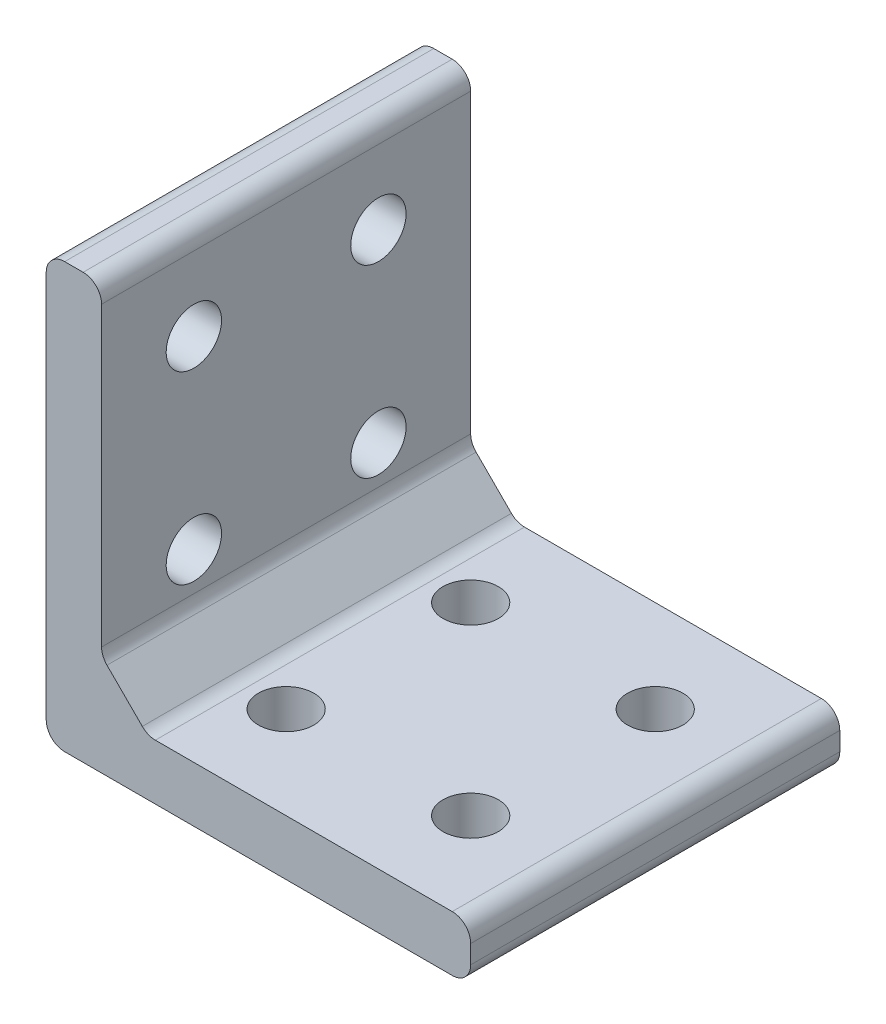
ISO-10303-21;
HEADER;
FILE_DESCRIPTION(('STEP AP214'),'2;1');
FILE_NAME('part.step','',(''),(''),'','','');
FILE_SCHEMA(('AUTOMOTIVE_DESIGN { 1 0 10303 214 1 1 1 1 }'));
ENDSEC;
DATA;
#1=APPLICATION_CONTEXT('core data for automotive mechanical design processes');
#2=APPLICATION_PROTOCOL_DEFINITION('international standard','automotive_design',2000,#1);
#3=PRODUCT_CONTEXT('',#1,'mechanical');
#4=PRODUCT('Part','Part','',(#3));
#5=PRODUCT_RELATED_PRODUCT_CATEGORY('part','',(#4));
#6=PRODUCT_DEFINITION_FORMATION('','',#4);
#7=PRODUCT_DEFINITION_CONTEXT('part definition',#1,'design');
#8=PRODUCT_DEFINITION('design','',#6,#7);
#9=PRODUCT_DEFINITION_SHAPE('','',#8);
#10=(LENGTH_UNIT() NAMED_UNIT(*) SI_UNIT(.MILLI.,.METRE.));
#11=(NAMED_UNIT(*) PLANE_ANGLE_UNIT() SI_UNIT($,.RADIAN.));
#12=(NAMED_UNIT(*) SI_UNIT($,.STERADIAN.) SOLID_ANGLE_UNIT());
#13=UNCERTAINTY_MEASURE_WITH_UNIT(LENGTH_MEASURE(1.E-05),#10,'distance_accuracy_value','');
#14=(GEOMETRIC_REPRESENTATION_CONTEXT(3) GLOBAL_UNCERTAINTY_ASSIGNED_CONTEXT((#13)) GLOBAL_UNIT_ASSIGNED_CONTEXT((#10,
#11,#12)) REPRESENTATION_CONTEXT('',''));
#15=CARTESIAN_POINT('',(0.,0.,0.));
#16=DIRECTION('',(0.,0.,1.));
#17=DIRECTION('',(1.,0.,0.));
#18=AXIS2_PLACEMENT_3D('',#15,#16,#17);
#19=CARTESIAN_POINT('',(23.,3.,20.));
#20=DIRECTION('',(-1.,0.,0.));
#21=DIRECTION('',(0.,-1.,0.));
#22=AXIS2_PLACEMENT_3D('',#19,#20,#21);
#23=PLANE('',#22);
#24=DIRECTION('',(0.,1.,0.));
#25=VECTOR('',#24,1.);
#26=CARTESIAN_POINT('',(23.,3.,0.));
#27=LINE('',#26,#25);
#28=CARTESIAN_POINT('',(23.,0.999999999999997,0.));
#29=VERTEX_POINT('',#28);
#30=CARTESIAN_POINT('',(23.,2.,0.));
#31=VERTEX_POINT('',#30);
#32=EDGE_CURVE('E174',#29,#31,#27,.T.);
#33=ORIENTED_EDGE('',*,*,#32,.T.);
#34=DIRECTION('',(0.,0.,-1.));
#35=VECTOR('',#34,1.);
#36=CARTESIAN_POINT('',(23.,2.,20.));
#37=LINE('',#36,#35);
#38=CARTESIAN_POINT('',(23.,2.,20.));
#39=VERTEX_POINT('',#38);
#40=EDGE_CURVE('E147',#31,#39,#37,.F.);
#41=ORIENTED_EDGE('',*,*,#40,.T.);
#42=DIRECTION('',(0.,1.,0.));
#43=VECTOR('',#42,1.);
#44=CARTESIAN_POINT('',(23.,3.,20.));
#45=LINE('',#44,#43);
#46=CARTESIAN_POINT('',(23.,0.999999999999997,20.));
#47=VERTEX_POINT('',#46);
#48=EDGE_CURVE('E195',#47,#39,#45,.T.);
#49=ORIENTED_EDGE('',*,*,#48,.F.);
#50=DIRECTION('',(0.,0.,-1.));
#51=VECTOR('',#50,1.);
#52=CARTESIAN_POINT('',(23.,0.999999999999997,20.));
#53=LINE('',#52,#51);
#54=EDGE_CURVE('E153',#47,#29,#53,.T.);
#55=ORIENTED_EDGE('',*,*,#54,.T.);
#56=EDGE_LOOP('',(#33,#41,#49,#55));
#57=FACE_BOUND('',#56,.T.);
#58=ADVANCED_FACE('F39',(#57),#23,.F.);
#59=CARTESIAN_POINT('',(3.,3.,20.));
#60=DIRECTION('',(0.,-1.,0.));
#61=DIRECTION('',(1.,0.,0.));
#62=AXIS2_PLACEMENT_3D('',#59,#60,#61);
#63=PLANE('',#62);
#64=CARTESIAN_POINT('',(7.99999999999997,3.,5.));
#65=DIRECTION('',(0.,1.,0.));
#66=DIRECTION('',(-1.,0.,0.));
#67=AXIS2_PLACEMENT_3D('',#64,#65,#66);
#68=CIRCLE('',#67,1.5);
#69=CARTESIAN_POINT('',(6.49999999999997,3.,5.));
#70=VERTEX_POINT('',#69);
#71=EDGE_CURVE('E229',#70,#70,#68,.T.);
#72=ORIENTED_EDGE('',*,*,#71,.F.);
#73=EDGE_LOOP('',(#72));
#74=FACE_BOUND('',#73,.T.);
#75=CARTESIAN_POINT('',(18.,3.,5.));
#76=DIRECTION('',(0.,1.,0.));
#77=DIRECTION('',(-1.,0.,0.));
#78=AXIS2_PLACEMENT_3D('',#75,#76,#77);
#79=CIRCLE('',#78,1.5);
#80=CARTESIAN_POINT('',(16.5,3.,5.));
#81=VERTEX_POINT('',#80);
#82=EDGE_CURVE('E479',#81,#81,#79,.T.);
#83=ORIENTED_EDGE('',*,*,#82,.F.);
#84=EDGE_LOOP('',(#83));
#85=FACE_BOUND('',#84,.T.);
#86=CARTESIAN_POINT('',(18.,3.,15.));
#87=DIRECTION('',(0.,1.,0.));
#88=DIRECTION('',(-1.,0.,0.));
#89=AXIS2_PLACEMENT_3D('',#86,#87,#88);
#90=CIRCLE('',#89,1.5);
#91=CARTESIAN_POINT('',(16.5,3.,15.));
#92=VERTEX_POINT('',#91);
#93=EDGE_CURVE('E475',#92,#92,#90,.T.);
#94=ORIENTED_EDGE('',*,*,#93,.F.);
#95=EDGE_LOOP('',(#94));
#96=FACE_BOUND('',#95,.T.);
#97=CARTESIAN_POINT('',(8.,3.,15.));
#98=DIRECTION('',(0.,1.,0.));
#99=DIRECTION('',(-1.,0.,0.));
#100=AXIS2_PLACEMENT_3D('',#97,#98,#99);
#101=CIRCLE('',#100,1.5);
#102=CARTESIAN_POINT('',(6.5,3.,15.));
#103=VERTEX_POINT('',#102);
#104=EDGE_CURVE('E201',#103,#103,#101,.T.);
#105=ORIENTED_EDGE('',*,*,#104,.F.);
#106=EDGE_LOOP('',(#105));
#107=FACE_BOUND('',#106,.T.);
#108=DIRECTION('',(-1.,0.,0.));
#109=VECTOR('',#108,1.);
#110=CARTESIAN_POINT('',(3.,3.,20.));
#111=LINE('',#110,#109);
#112=CARTESIAN_POINT('',(22.,3.,20.));
#113=VERTEX_POINT('',#112);
#114=CARTESIAN_POINT('',(5.9142135623731,3.,20.));
#115=VERTEX_POINT('',#114);
#116=EDGE_CURVE('E164',#113,#115,#111,.T.);
#117=ORIENTED_EDGE('',*,*,#116,.F.);
#118=DIRECTION('',(0.,0.,-1.));
#119=VECTOR('',#118,1.);
#120=CARTESIAN_POINT('',(22.,3.,20.));
#121=LINE('',#120,#119);
#122=CARTESIAN_POINT('',(22.,3.,0.));
#123=VERTEX_POINT('',#122);
#124=EDGE_CURVE('E146',#113,#123,#121,.T.);
#125=ORIENTED_EDGE('',*,*,#124,.T.);
#126=DIRECTION('',(-1.,0.,0.));
#127=VECTOR('',#126,1.);
#128=CARTESIAN_POINT('',(3.,3.,0.));
#129=LINE('',#128,#127);
#130=CARTESIAN_POINT('',(5.9142135623731,3.,0.));
#131=VERTEX_POINT('',#130);
#132=EDGE_CURVE('E161',#123,#131,#129,.T.);
#133=ORIENTED_EDGE('',*,*,#132,.T.);
#134=DIRECTION('',(0.,0.,-1.));
#135=VECTOR('',#134,1.);
#136=CARTESIAN_POINT('',(5.9142135623731,3.,20.));
#137=LINE('',#136,#135);
#138=EDGE_CURVE('E167',#131,#115,#137,.F.);
#139=ORIENTED_EDGE('',*,*,#138,.T.);
#140=EDGE_LOOP('',(#117,#125,#133,#139));
#141=FACE_BOUND('',#140,.T.);
#142=ADVANCED_FACE('F159',(#74,#85,#96,#107,#141),#63,.F.);
#143=CARTESIAN_POINT('',(3.00000000000002,23.,20.));
#144=DIRECTION('',(-1.,0.,0.));
#145=DIRECTION('',(0.,-1.,0.));
#146=AXIS2_PLACEMENT_3D('',#143,#144,#145);
#147=PLANE('',#146);
#148=CARTESIAN_POINT('',(3.00000000000001,8.,14.9999999999999));
#149=DIRECTION('',(1.,0.,0.));
#150=DIRECTION('',(0.,1.,0.));
#151=AXIS2_PLACEMENT_3D('',#148,#149,#150);
#152=CIRCLE('',#151,1.5);
#153=CARTESIAN_POINT('',(3.00000000000001,9.5,14.9999999999999));
#154=VERTEX_POINT('',#153);
#155=EDGE_CURVE('E469',#154,#154,#152,.T.);
#156=ORIENTED_EDGE('',*,*,#155,.F.);
#157=EDGE_LOOP('',(#156));
#158=FACE_BOUND('',#157,.T.);
#159=CARTESIAN_POINT('',(3.00000000000001,8.,4.9999999999999));
#160=DIRECTION('',(1.,0.,0.));
#161=DIRECTION('',(0.,1.,0.));
#162=AXIS2_PLACEMENT_3D('',#159,#160,#161);
#163=CIRCLE('',#162,1.5);
#164=CARTESIAN_POINT('',(3.00000000000001,9.5,4.9999999999999));
#165=VERTEX_POINT('',#164);
#166=EDGE_CURVE('E462',#165,#165,#163,.T.);
#167=ORIENTED_EDGE('',*,*,#166,.F.);
#168=EDGE_LOOP('',(#167));
#169=FACE_BOUND('',#168,.T.);
#170=CARTESIAN_POINT('',(3.00000000000002,18.,5.));
#171=DIRECTION('',(1.,0.,0.));
#172=DIRECTION('',(0.,1.,0.));
#173=AXIS2_PLACEMENT_3D('',#170,#171,#172);
#174=CIRCLE('',#173,1.5);
#175=CARTESIAN_POINT('',(3.00000000000002,19.5,5.));
#176=VERTEX_POINT('',#175);
#177=EDGE_CURVE('E454',#176,#176,#174,.T.);
#178=ORIENTED_EDGE('',*,*,#177,.F.);
#179=EDGE_LOOP('',(#178));
#180=FACE_BOUND('',#179,.T.);
#181=CARTESIAN_POINT('',(3.00000000000002,18.,15.));
#182=DIRECTION('',(1.,0.,0.));
#183=DIRECTION('',(0.,1.,0.));
#184=AXIS2_PLACEMENT_3D('',#181,#182,#183);
#185=CIRCLE('',#184,1.5);
#186=CARTESIAN_POINT('',(3.00000000000002,19.5,15.));
#187=VERTEX_POINT('',#186);
#188=EDGE_CURVE('E217',#187,#187,#185,.T.);
#189=ORIENTED_EDGE('',*,*,#188,.F.);
#190=EDGE_LOOP('',(#189));
#191=FACE_BOUND('',#190,.T.);
#192=DIRECTION('',(0.,1.,0.));
#193=VECTOR('',#192,1.);
#194=CARTESIAN_POINT('',(3.00000000000002,23.,0.));
#195=LINE('',#194,#193);
#196=CARTESIAN_POINT('',(3.00000000000001,5.91421356237311,0.));
#197=VERTEX_POINT('',#196);
#198=CARTESIAN_POINT('',(3.00000000000002,22.,0.));
#199=VERTEX_POINT('',#198);
#200=EDGE_CURVE('E173',#197,#199,#195,.T.);
#201=ORIENTED_EDGE('',*,*,#200,.T.);
#202=DIRECTION('',(0.,0.,-1.));
#203=VECTOR('',#202,1.);
#204=CARTESIAN_POINT('',(3.00000000000002,22.,20.));
#205=LINE('',#204,#203);
#206=CARTESIAN_POINT('',(3.00000000000002,22.,20.));
#207=VERTEX_POINT('',#206);
#208=EDGE_CURVE('E286',#199,#207,#205,.F.);
#209=ORIENTED_EDGE('',*,*,#208,.T.);
#210=DIRECTION('',(0.,1.,0.));
#211=VECTOR('',#210,1.);
#212=CARTESIAN_POINT('',(3.00000000000002,23.,20.));
#213=LINE('',#212,#211);
#214=CARTESIAN_POINT('',(3.00000000000001,5.91421356237311,20.));
#215=VERTEX_POINT('',#214);
#216=EDGE_CURVE('E368',#215,#207,#213,.T.);
#217=ORIENTED_EDGE('',*,*,#216,.F.);
#218=DIRECTION('',(0.,0.,1.));
#219=VECTOR('',#218,1.);
#220=CARTESIAN_POINT('',(3.00000000000001,5.91421356237311,0.));
#221=LINE('',#220,#219);
#222=EDGE_CURVE('E282',#215,#197,#221,.F.);
#223=ORIENTED_EDGE('',*,*,#222,.T.);
#224=EDGE_LOOP('',(#201,#209,#217,#223));
#225=FACE_BOUND('',#224,.T.);
#226=ADVANCED_FACE('F331',(#158,#169,#180,#191,#225),#147,.F.);
#227=CARTESIAN_POINT('',(0.,23.,20.));
#228=DIRECTION('',(0.,-1.,0.));
#229=DIRECTION('',(0.,0.,-1.));
#230=AXIS2_PLACEMENT_3D('',#227,#228,#229);
#231=PLANE('',#230);
#232=DIRECTION('',(-1.,0.,0.));
#233=VECTOR('',#232,1.);
#234=CARTESIAN_POINT('',(0.,23.,20.));
#235=LINE('',#234,#233);
#236=CARTESIAN_POINT('',(2.00000000000002,23.,20.));
#237=VERTEX_POINT('',#236);
#238=CARTESIAN_POINT('',(1.,23.,20.));
#239=VERTEX_POINT('',#238);
#240=EDGE_CURVE('E376',#237,#239,#235,.T.);
#241=ORIENTED_EDGE('',*,*,#240,.F.);
#242=DIRECTION('',(0.,0.,-1.));
#243=VECTOR('',#242,1.);
#244=CARTESIAN_POINT('',(2.00000000000002,23.,20.));
#245=LINE('',#244,#243);
#246=CARTESIAN_POINT('',(2.00000000000002,23.,0.));
#247=VERTEX_POINT('',#246);
#248=EDGE_CURVE('E278',#237,#247,#245,.T.);
#249=ORIENTED_EDGE('',*,*,#248,.T.);
#250=DIRECTION('',(-1.,0.,0.));
#251=VECTOR('',#250,1.);
#252=CARTESIAN_POINT('',(0.,23.,0.));
#253=LINE('',#252,#251);
#254=CARTESIAN_POINT('',(1.,23.,0.));
#255=VERTEX_POINT('',#254);
#256=EDGE_CURVE('E179',#247,#255,#253,.T.);
#257=ORIENTED_EDGE('',*,*,#256,.T.);
#258=DIRECTION('',(0.,0.,-1.));
#259=VECTOR('',#258,1.);
#260=CARTESIAN_POINT('',(1.,23.,20.));
#261=LINE('',#260,#259);
#262=EDGE_CURVE('E275',#255,#239,#261,.F.);
#263=ORIENTED_EDGE('',*,*,#262,.T.);
#264=EDGE_LOOP('',(#241,#249,#257,#263));
#265=FACE_BOUND('',#264,.T.);
#266=ADVANCED_FACE('F392',(#265),#231,.F.);
#267=CARTESIAN_POINT('',(0.,0.,20.));
#268=DIRECTION('',(1.,0.,0.));
#269=DIRECTION('',(0.,0.,-1.));
#270=AXIS2_PLACEMENT_3D('',#267,#268,#269);
#271=PLANE('',#270);
#272=CARTESIAN_POINT('',(0.,8.,14.9999999999999));
#273=DIRECTION('',(1.,0.,0.));
#274=DIRECTION('',(0.,0.,-1.));
#275=AXIS2_PLACEMENT_3D('',#272,#273,#274);
#276=CIRCLE('',#275,1.5);
#277=CARTESIAN_POINT('',(0.,8.,13.4999999999999));
#278=VERTEX_POINT('',#277);
#279=EDGE_CURVE('E225',#278,#278,#276,.T.);
#280=ORIENTED_EDGE('',*,*,#279,.T.);
#281=EDGE_LOOP('',(#280));
#282=FACE_BOUND('',#281,.T.);
#283=CARTESIAN_POINT('',(0.,8.,4.9999999999999));
#284=DIRECTION('',(1.,0.,0.));
#285=DIRECTION('',(0.,0.,-1.));
#286=AXIS2_PLACEMENT_3D('',#283,#284,#285);
#287=CIRCLE('',#286,1.5);
#288=CARTESIAN_POINT('',(0.,8.,3.49999999999989));
#289=VERTEX_POINT('',#288);
#290=EDGE_CURVE('E221',#289,#289,#287,.T.);
#291=ORIENTED_EDGE('',*,*,#290,.T.);
#292=EDGE_LOOP('',(#291));
#293=FACE_BOUND('',#292,.T.);
#294=CARTESIAN_POINT('',(0.,18.,5.));
#295=DIRECTION('',(1.,0.,0.));
#296=DIRECTION('',(0.,0.,-1.));
#297=AXIS2_PLACEMENT_3D('',#294,#295,#296);
#298=CIRCLE('',#297,1.5);
#299=CARTESIAN_POINT('',(0.,18.,3.5));
#300=VERTEX_POINT('',#299);
#301=EDGE_CURVE('E216',#300,#300,#298,.T.);
#302=ORIENTED_EDGE('',*,*,#301,.T.);
#303=EDGE_LOOP('',(#302));
#304=FACE_BOUND('',#303,.T.);
#305=CARTESIAN_POINT('',(0.,18.,15.));
#306=DIRECTION('',(1.,0.,0.));
#307=DIRECTION('',(0.,0.,-1.));
#308=AXIS2_PLACEMENT_3D('',#305,#306,#307);
#309=CIRCLE('',#308,1.5);
#310=CARTESIAN_POINT('',(0.,18.,13.5));
#311=VERTEX_POINT('',#310);
#312=EDGE_CURVE('E212',#311,#311,#309,.T.);
#313=ORIENTED_EDGE('',*,*,#312,.T.);
#314=EDGE_LOOP('',(#313));
#315=FACE_BOUND('',#314,.T.);
#316=DIRECTION('',(0.,-1.,0.));
#317=VECTOR('',#316,1.);
#318=CARTESIAN_POINT('',(0.,0.,20.));
#319=LINE('',#318,#317);
#320=CARTESIAN_POINT('',(0.,22.,20.));
#321=VERTEX_POINT('',#320);
#322=CARTESIAN_POINT('',(0.,1.,20.));
#323=VERTEX_POINT('',#322);
#324=EDGE_CURVE('E380',#321,#323,#319,.T.);
#325=ORIENTED_EDGE('',*,*,#324,.F.);
#326=DIRECTION('',(0.,0.,-1.));
#327=VECTOR('',#326,1.);
#328=CARTESIAN_POINT('',(0.,22.,20.));
#329=LINE('',#328,#327);
#330=CARTESIAN_POINT('',(0.,22.,0.));
#331=VERTEX_POINT('',#330);
#332=EDGE_CURVE('E292',#321,#331,#329,.T.);
#333=ORIENTED_EDGE('',*,*,#332,.T.);
#334=DIRECTION('',(0.,-1.,0.));
#335=VECTOR('',#334,1.);
#336=CARTESIAN_POINT('',(0.,0.,0.));
#337=LINE('',#336,#335);
#338=CARTESIAN_POINT('',(0.,1.,0.));
#339=VERTEX_POINT('',#338);
#340=EDGE_CURVE('E188',#331,#339,#337,.T.);
#341=ORIENTED_EDGE('',*,*,#340,.T.);
#342=DIRECTION('',(0.,0.,-1.));
#343=VECTOR('',#342,1.);
#344=CARTESIAN_POINT('',(0.,1.,20.));
#345=LINE('',#344,#343);
#346=EDGE_CURVE('E289',#339,#323,#345,.F.);
#347=ORIENTED_EDGE('',*,*,#346,.T.);
#348=EDGE_LOOP('',(#325,#333,#341,#347));
#349=FACE_BOUND('',#348,.T.);
#350=ADVANCED_FACE('F387',(#282,#293,#304,#315,#349),#271,.F.);
#351=CARTESIAN_POINT('',(23.,0.,20.));
#352=DIRECTION('',(0.,1.,0.));
#353=DIRECTION('',(-1.,0.,0.));
#354=AXIS2_PLACEMENT_3D('',#351,#352,#353);
#355=PLANE('',#354);
#356=CARTESIAN_POINT('',(7.99999999999997,0.,5.));
#357=DIRECTION('',(0.,1.,0.));
#358=DIRECTION('',(-1.,0.,0.));
#359=AXIS2_PLACEMENT_3D('',#356,#357,#358);
#360=CIRCLE('',#359,1.5);
#361=CARTESIAN_POINT('',(6.49999999999997,0.,5.));
#362=VERTEX_POINT('',#361);
#363=EDGE_CURVE('E181',#362,#362,#360,.T.);
#364=ORIENTED_EDGE('',*,*,#363,.T.);
#365=EDGE_LOOP('',(#364));
#366=FACE_BOUND('',#365,.T.);
#367=CARTESIAN_POINT('',(18.,0.,5.));
#368=DIRECTION('',(0.,1.,0.));
#369=DIRECTION('',(-1.,0.,0.));
#370=AXIS2_PLACEMENT_3D('',#367,#368,#369);
#371=CIRCLE('',#370,1.5);
#372=CARTESIAN_POINT('',(16.5,0.,5.));
#373=VERTEX_POINT('',#372);
#374=EDGE_CURVE('E205',#373,#373,#371,.T.);
#375=ORIENTED_EDGE('',*,*,#374,.T.);
#376=EDGE_LOOP('',(#375));
#377=FACE_BOUND('',#376,.T.);
#378=CARTESIAN_POINT('',(18.,0.,15.));
#379=DIRECTION('',(0.,1.,0.));
#380=DIRECTION('',(-1.,0.,0.));
#381=AXIS2_PLACEMENT_3D('',#378,#379,#380);
#382=CIRCLE('',#381,1.5);
#383=CARTESIAN_POINT('',(16.5,0.,15.));
#384=VERTEX_POINT('',#383);
#385=EDGE_CURVE('E200',#384,#384,#382,.T.);
#386=ORIENTED_EDGE('',*,*,#385,.T.);
#387=EDGE_LOOP('',(#386));
#388=FACE_BOUND('',#387,.T.);
#389=CARTESIAN_POINT('',(8.,0.,15.));
#390=DIRECTION('',(0.,1.,0.));
#391=DIRECTION('',(-1.,0.,0.));
#392=AXIS2_PLACEMENT_3D('',#389,#390,#391);
#393=CIRCLE('',#392,1.5);
#394=CARTESIAN_POINT('',(6.5,0.,15.));
#395=VERTEX_POINT('',#394);
#396=EDGE_CURVE('E196',#395,#395,#393,.T.);
#397=ORIENTED_EDGE('',*,*,#396,.T.);
#398=EDGE_LOOP('',(#397));
#399=FACE_BOUND('',#398,.T.);
#400=DIRECTION('',(1.,0.,0.));
#401=VECTOR('',#400,1.);
#402=CARTESIAN_POINT('',(23.,0.,0.));
#403=LINE('',#402,#401);
#404=CARTESIAN_POINT('',(1.00000000000001,0.,0.));
#405=VERTEX_POINT('',#404);
#406=CARTESIAN_POINT('',(22.,0.,0.));
#407=VERTEX_POINT('',#406);
#408=EDGE_CURVE('E192',#405,#407,#403,.T.);
#409=ORIENTED_EDGE('',*,*,#408,.T.);
#410=DIRECTION('',(0.,0.,-1.));
#411=VECTOR('',#410,1.);
#412=CARTESIAN_POINT('',(22.,0.,20.));
#413=LINE('',#412,#411);
#414=CARTESIAN_POINT('',(22.,0.,20.));
#415=VERTEX_POINT('',#414);
#416=EDGE_CURVE('E55',#407,#415,#413,.F.);
#417=ORIENTED_EDGE('',*,*,#416,.T.);
#418=DIRECTION('',(1.,0.,0.));
#419=VECTOR('',#418,1.);
#420=CARTESIAN_POINT('',(23.,0.,20.));
#421=LINE('',#420,#419);
#422=CARTESIAN_POINT('',(1.00000000000001,0.,20.));
#423=VERTEX_POINT('',#422);
#424=EDGE_CURVE('E234',#423,#415,#421,.T.);
#425=ORIENTED_EDGE('',*,*,#424,.F.);
#426=DIRECTION('',(0.,0.,-1.));
#427=VECTOR('',#426,1.);
#428=CARTESIAN_POINT('',(1.,0.,20.));
#429=LINE('',#428,#427);
#430=EDGE_CURVE('E269',#423,#405,#429,.T.);
#431=ORIENTED_EDGE('',*,*,#430,.T.);
#432=EDGE_LOOP('',(#409,#417,#425,#431));
#433=FACE_BOUND('',#432,.T.);
#434=ADVANCED_FACE('F360',(#366,#377,#388,#399,#433),#355,.F.);
#435=CARTESIAN_POINT('',(0.,0.,20.));
#436=DIRECTION('',(0.,0.,-1.));
#437=DIRECTION('',(-1.,0.,0.));
#438=AXIS2_PLACEMENT_3D('',#435,#436,#437);
#439=PLANE('',#438);
#440=ORIENTED_EDGE('',*,*,#48,.T.);
#441=CARTESIAN_POINT('',(22.,2.,20.));
#442=DIRECTION('',(0.,0.,-1.));
#443=DIRECTION('',(-1.,0.,0.));
#444=AXIS2_PLACEMENT_3D('',#441,#442,#443);
#445=CIRCLE('',#444,1.);
#446=EDGE_CURVE('E266',#39,#113,#445,.F.);
#447=ORIENTED_EDGE('',*,*,#446,.T.);
#448=ORIENTED_EDGE('',*,*,#116,.T.);
#449=CARTESIAN_POINT('',(5.9142135623731,4.,20.));
#450=DIRECTION('',(0.,0.,-1.));
#451=DIRECTION('',(-1.,0.,0.));
#452=AXIS2_PLACEMENT_3D('',#449,#450,#451);
#453=CIRCLE('',#452,1.);
#454=CARTESIAN_POINT('',(5.20710678118655,3.29289321881346,20.));
#455=VERTEX_POINT('',#454);
#456=EDGE_CURVE('E48',#115,#455,#453,.T.);
#457=ORIENTED_EDGE('',*,*,#456,.T.);
#458=DIRECTION('',(0.707106781186545,-0.70710678118655,0.));
#459=VECTOR('',#458,1.);
#460=CARTESIAN_POINT('',(4.25000000000002,4.24999999999999,20.));
#461=LINE('',#460,#459);
#462=CARTESIAN_POINT('',(3.29289321881346,5.20710678118656,20.));
#463=VERTEX_POINT('',#462);
#464=EDGE_CURVE('E233',#455,#463,#461,.F.);
#465=ORIENTED_EDGE('',*,*,#464,.T.);
#466=CARTESIAN_POINT('',(4.00000000000001,5.91421356237311,20.));
#467=DIRECTION('',(0.,0.,-1.));
#468=DIRECTION('',(-1.,0.,0.));
#469=AXIS2_PLACEMENT_3D('',#466,#467,#468);
#470=CIRCLE('',#469,1.);
#471=EDGE_CURVE('E305',#463,#215,#470,.T.);
#472=ORIENTED_EDGE('',*,*,#471,.T.);
#473=ORIENTED_EDGE('',*,*,#216,.T.);
#474=CARTESIAN_POINT('',(2.00000000000002,22.,20.));
#475=DIRECTION('',(0.,0.,-1.));
#476=DIRECTION('',(-1.,0.,0.));
#477=AXIS2_PLACEMENT_3D('',#474,#475,#476);
#478=CIRCLE('',#477,1.);
#479=EDGE_CURVE('E260',#207,#237,#478,.F.);
#480=ORIENTED_EDGE('',*,*,#479,.T.);
#481=ORIENTED_EDGE('',*,*,#240,.T.);
#482=CARTESIAN_POINT('',(1.,22.,20.));
#483=DIRECTION('',(0.,0.,-1.));
#484=DIRECTION('',(-1.,0.,0.));
#485=AXIS2_PLACEMENT_3D('',#482,#483,#484);
#486=CIRCLE('',#485,1.);
#487=EDGE_CURVE('E257',#239,#321,#486,.F.);
#488=ORIENTED_EDGE('',*,*,#487,.T.);
#489=ORIENTED_EDGE('',*,*,#324,.T.);
#490=CARTESIAN_POINT('',(1.,1.,20.));
#491=DIRECTION('',(0.,0.,-1.));
#492=DIRECTION('',(-1.,0.,0.));
#493=AXIS2_PLACEMENT_3D('',#490,#491,#492);
#494=CIRCLE('',#493,1.);
#495=EDGE_CURVE('E62',#323,#423,#494,.F.);
#496=ORIENTED_EDGE('',*,*,#495,.T.);
#497=ORIENTED_EDGE('',*,*,#424,.T.);
#498=CARTESIAN_POINT('',(22.,0.999999999999998,20.));
#499=DIRECTION('',(0.,0.,-1.));
#500=DIRECTION('',(-1.,0.,0.));
#501=AXIS2_PLACEMENT_3D('',#498,#499,#500);
#502=CIRCLE('',#501,1.);
#503=EDGE_CURVE('E263',#415,#47,#502,.F.);
#504=ORIENTED_EDGE('',*,*,#503,.T.);
#505=EDGE_LOOP('',(#440,#447,#448,#457,#465,#472,#473,#480,#481,#488,#489,#496,#497,#504));
#506=FACE_BOUND('',#505,.T.);
#507=ADVANCED_FACE('F310',(#506),#439,.F.);
#508=CARTESIAN_POINT('',(0.,0.,0.));
#509=DIRECTION('',(0.,0.,-1.));
#510=DIRECTION('',(-1.,0.,0.));
#511=AXIS2_PLACEMENT_3D('',#508,#509,#510);
#512=PLANE('',#511);
#513=ORIENTED_EDGE('',*,*,#132,.F.);
#514=CARTESIAN_POINT('',(22.,2.,0.));
#515=DIRECTION('',(0.,0.,-1.));
#516=DIRECTION('',(-1.,0.,0.));
#517=AXIS2_PLACEMENT_3D('',#514,#515,#516);
#518=CIRCLE('',#517,1.);
#519=EDGE_CURVE('E142',#123,#31,#518,.T.);
#520=ORIENTED_EDGE('',*,*,#519,.T.);
#521=ORIENTED_EDGE('',*,*,#32,.F.);
#522=CARTESIAN_POINT('',(22.,0.999999999999998,0.));
#523=DIRECTION('',(0.,0.,-1.));
#524=DIRECTION('',(-1.,0.,0.));
#525=AXIS2_PLACEMENT_3D('',#522,#523,#524);
#526=CIRCLE('',#525,1.);
#527=EDGE_CURVE('E154',#29,#407,#526,.T.);
#528=ORIENTED_EDGE('',*,*,#527,.T.);
#529=ORIENTED_EDGE('',*,*,#408,.F.);
#530=CARTESIAN_POINT('',(1.,1.,0.));
#531=DIRECTION('',(0.,0.,-1.));
#532=DIRECTION('',(-1.,0.,0.));
#533=AXIS2_PLACEMENT_3D('',#530,#531,#532);
#534=CIRCLE('',#533,1.);
#535=EDGE_CURVE('E166',#405,#339,#534,.T.);
#536=ORIENTED_EDGE('',*,*,#535,.T.);
#537=ORIENTED_EDGE('',*,*,#340,.F.);
#538=CARTESIAN_POINT('',(1.,22.,0.));
#539=DIRECTION('',(0.,0.,-1.));
#540=DIRECTION('',(-1.,0.,0.));
#541=AXIS2_PLACEMENT_3D('',#538,#539,#540);
#542=CIRCLE('',#541,1.);
#543=EDGE_CURVE('E242',#331,#255,#542,.T.);
#544=ORIENTED_EDGE('',*,*,#543,.T.);
#545=ORIENTED_EDGE('',*,*,#256,.F.);
#546=CARTESIAN_POINT('',(2.00000000000002,22.,0.));
#547=DIRECTION('',(0.,0.,-1.));
#548=DIRECTION('',(-1.,0.,0.));
#549=AXIS2_PLACEMENT_3D('',#546,#547,#548);
#550=CIRCLE('',#549,1.);
#551=EDGE_CURVE('E245',#247,#199,#550,.T.);
#552=ORIENTED_EDGE('',*,*,#551,.T.);
#553=ORIENTED_EDGE('',*,*,#200,.F.);
#554=CARTESIAN_POINT('',(4.00000000000001,5.91421356237311,0.));
#555=DIRECTION('',(0.,0.,-1.));
#556=DIRECTION('',(-1.,0.,0.));
#557=AXIS2_PLACEMENT_3D('',#554,#555,#556);
#558=CIRCLE('',#557,1.);
#559=CARTESIAN_POINT('',(3.29289321881346,5.20710678118656,0.));
#560=VERTEX_POINT('',#559);
#561=EDGE_CURVE('E302',#197,#560,#558,.F.);
#562=ORIENTED_EDGE('',*,*,#561,.T.);
#563=DIRECTION('',(-0.707106781186545,0.70710678118655,0.));
#564=VECTOR('',#563,1.);
#565=CARTESIAN_POINT('',(3.00000000000001,5.50000000000002,0.));
#566=LINE('',#565,#564);
#567=CARTESIAN_POINT('',(5.20710678118655,3.29289321881345,0.));
#568=VERTEX_POINT('',#567);
#569=EDGE_CURVE('E230',#560,#568,#566,.F.);
#570=ORIENTED_EDGE('',*,*,#569,.T.);
#571=CARTESIAN_POINT('',(5.9142135623731,4.,0.));
#572=DIRECTION('',(0.,0.,-1.));
#573=DIRECTION('',(-1.,0.,0.));
#574=AXIS2_PLACEMENT_3D('',#571,#572,#573);
#575=CIRCLE('',#574,1.);
#576=EDGE_CURVE('E11',#568,#131,#575,.F.);
#577=ORIENTED_EDGE('',*,*,#576,.T.);
#578=EDGE_LOOP('',(#513,#520,#521,#528,#529,#536,#537,#544,#545,#552,#553,#562,#570,#577));
#579=FACE_BOUND('',#578,.T.);
#580=ADVANCED_FACE('F169',(#579),#512,.T.);
#581=CARTESIAN_POINT('',(8.,-17.,15.));
#582=DIRECTION('',(0.,1.,0.));
#583=DIRECTION('',(-1.,0.,0.));
#584=AXIS2_PLACEMENT_3D('',#581,#582,#583);
#585=CYLINDRICAL_SURFACE('',#584,1.5);
#586=ORIENTED_EDGE('',*,*,#104,.T.);
#587=EDGE_LOOP('',(#586));
#588=FACE_BOUND('',#587,.T.);
#589=ORIENTED_EDGE('',*,*,#396,.F.);
#590=EDGE_LOOP('',(#589));
#591=FACE_BOUND('',#590,.T.);
#592=ADVANCED_FACE('F417',(#588,#591),#585,.F.);
#593=CARTESIAN_POINT('',(18.,-17.,15.));
#594=DIRECTION('',(0.,1.,0.));
#595=DIRECTION('',(-1.,0.,0.));
#596=AXIS2_PLACEMENT_3D('',#593,#594,#595);
#597=CYLINDRICAL_SURFACE('',#596,1.5);
#598=ORIENTED_EDGE('',*,*,#93,.T.);
#599=EDGE_LOOP('',(#598));
#600=FACE_BOUND('',#599,.T.);
#601=ORIENTED_EDGE('',*,*,#385,.F.);
#602=EDGE_LOOP('',(#601));
#603=FACE_BOUND('',#602,.T.);
#604=ADVANCED_FACE('F422',(#600,#603),#597,.F.);
#605=CARTESIAN_POINT('',(18.,-17.,5.));
#606=DIRECTION('',(0.,1.,0.));
#607=DIRECTION('',(-1.,0.,0.));
#608=AXIS2_PLACEMENT_3D('',#605,#606,#607);
#609=CYLINDRICAL_SURFACE('',#608,1.5);
#610=ORIENTED_EDGE('',*,*,#82,.T.);
#611=EDGE_LOOP('',(#610));
#612=FACE_BOUND('',#611,.T.);
#613=ORIENTED_EDGE('',*,*,#374,.F.);
#614=EDGE_LOOP('',(#613));
#615=FACE_BOUND('',#614,.T.);
#616=ADVANCED_FACE('F428',(#612,#615),#609,.F.);
#617=CARTESIAN_POINT('',(7.99999999999997,-17.,5.));
#618=DIRECTION('',(0.,1.,0.));
#619=DIRECTION('',(-1.,0.,0.));
#620=AXIS2_PLACEMENT_3D('',#617,#618,#619);
#621=CYLINDRICAL_SURFACE('',#620,1.5);
#622=ORIENTED_EDGE('',*,*,#71,.T.);
#623=EDGE_LOOP('',(#622));
#624=FACE_BOUND('',#623,.T.);
#625=ORIENTED_EDGE('',*,*,#363,.F.);
#626=EDGE_LOOP('',(#625));
#627=FACE_BOUND('',#626,.T.);
#628=ADVANCED_FACE('F424',(#624,#627),#621,.F.);
#629=CARTESIAN_POINT('',(-17.,18.,15.));
#630=DIRECTION('',(1.,0.,0.));
#631=DIRECTION('',(0.,1.,0.));
#632=AXIS2_PLACEMENT_3D('',#629,#630,#631);
#633=CYLINDRICAL_SURFACE('',#632,1.5);
#634=ORIENTED_EDGE('',*,*,#188,.T.);
#635=EDGE_LOOP('',(#634));
#636=FACE_BOUND('',#635,.T.);
#637=ORIENTED_EDGE('',*,*,#312,.F.);
#638=EDGE_LOOP('',(#637));
#639=FACE_BOUND('',#638,.T.);
#640=ADVANCED_FACE('F427',(#636,#639),#633,.F.);
#641=CARTESIAN_POINT('',(-17.,18.,5.));
#642=DIRECTION('',(1.,0.,0.));
#643=DIRECTION('',(0.,1.,0.));
#644=AXIS2_PLACEMENT_3D('',#641,#642,#643);
#645=CYLINDRICAL_SURFACE('',#644,1.5);
#646=ORIENTED_EDGE('',*,*,#177,.T.);
#647=EDGE_LOOP('',(#646));
#648=FACE_BOUND('',#647,.T.);
#649=ORIENTED_EDGE('',*,*,#301,.F.);
#650=EDGE_LOOP('',(#649));
#651=FACE_BOUND('',#650,.T.);
#652=ADVANCED_FACE('F438',(#648,#651),#645,.F.);
#653=CARTESIAN_POINT('',(-17.,8.00000000000002,4.9999999999999));
#654=DIRECTION('',(1.,0.,0.));
#655=DIRECTION('',(0.,1.,0.));
#656=AXIS2_PLACEMENT_3D('',#653,#654,#655);
#657=CYLINDRICAL_SURFACE('',#656,1.5);
#658=ORIENTED_EDGE('',*,*,#166,.T.);
#659=EDGE_LOOP('',(#658));
#660=FACE_BOUND('',#659,.T.);
#661=ORIENTED_EDGE('',*,*,#290,.F.);
#662=EDGE_LOOP('',(#661));
#663=FACE_BOUND('',#662,.T.);
#664=ADVANCED_FACE('F442',(#660,#663),#657,.F.);
#665=CARTESIAN_POINT('',(-17.,8.00000000000002,14.9999999999999));
#666=DIRECTION('',(1.,0.,0.));
#667=DIRECTION('',(0.,1.,0.));
#668=AXIS2_PLACEMENT_3D('',#665,#666,#667);
#669=CYLINDRICAL_SURFACE('',#668,1.5);
#670=ORIENTED_EDGE('',*,*,#155,.T.);
#671=EDGE_LOOP('',(#670));
#672=FACE_BOUND('',#671,.T.);
#673=ORIENTED_EDGE('',*,*,#279,.F.);
#674=EDGE_LOOP('',(#673));
#675=FACE_BOUND('',#674,.T.);
#676=ADVANCED_FACE('F338',(#672,#675),#669,.F.);
#677=CARTESIAN_POINT('',(3.00000000000001,5.50000000000002,20.));
#678=DIRECTION('',(0.70710678118655,0.707106781186545,0.));
#679=DIRECTION('',(0.,0.,1.));
#680=AXIS2_PLACEMENT_3D('',#677,#678,#679);
#681=PLANE('',#680);
#682=ORIENTED_EDGE('',*,*,#569,.F.);
#683=DIRECTION('',(0.,0.,-1.));
#684=VECTOR('',#683,1.);
#685=CARTESIAN_POINT('',(3.29289321881346,5.20710678118656,20.));
#686=LINE('',#685,#684);
#687=EDGE_CURVE('E299',#560,#463,#686,.F.);
#688=ORIENTED_EDGE('',*,*,#687,.T.);
#689=ORIENTED_EDGE('',*,*,#464,.F.);
#690=DIRECTION('',(0.,0.,1.));
#691=VECTOR('',#690,1.);
#692=CARTESIAN_POINT('',(5.20710678118655,3.29289321881345,0.));
#693=LINE('',#692,#691);
#694=EDGE_CURVE('E296',#455,#568,#693,.F.);
#695=ORIENTED_EDGE('',*,*,#694,.T.);
#696=EDGE_LOOP('',(#682,#688,#689,#695));
#697=FACE_BOUND('',#696,.T.);
#698=ADVANCED_FACE('F316',(#697),#681,.T.);
#699=CARTESIAN_POINT('',(22.,2.,20.));
#700=DIRECTION('',(0.,0.,-1.));
#701=DIRECTION('',(-1.,0.,0.));
#702=AXIS2_PLACEMENT_3D('',#699,#700,#701);
#703=CYLINDRICAL_SURFACE('',#702,1.);
#704=ORIENTED_EDGE('',*,*,#446,.F.);
#705=ORIENTED_EDGE('',*,*,#40,.F.);
#706=ORIENTED_EDGE('',*,*,#519,.F.);
#707=ORIENTED_EDGE('',*,*,#124,.F.);
#708=EDGE_LOOP('',(#704,#705,#706,#707));
#709=FACE_BOUND('',#708,.T.);
#710=ADVANCED_FACE('F145',(#709),#703,.T.);
#711=CARTESIAN_POINT('',(22.,0.999999999999998,20.));
#712=DIRECTION('',(0.,0.,-1.));
#713=DIRECTION('',(-1.,0.,0.));
#714=AXIS2_PLACEMENT_3D('',#711,#712,#713);
#715=CYLINDRICAL_SURFACE('',#714,1.);
#716=ORIENTED_EDGE('',*,*,#503,.F.);
#717=ORIENTED_EDGE('',*,*,#416,.F.);
#718=ORIENTED_EDGE('',*,*,#527,.F.);
#719=ORIENTED_EDGE('',*,*,#54,.F.);
#720=EDGE_LOOP('',(#716,#717,#718,#719));
#721=FACE_BOUND('',#720,.T.);
#722=ADVANCED_FACE('F341',(#721),#715,.T.);
#723=CARTESIAN_POINT('',(2.00000000000002,22.,20.));
#724=DIRECTION('',(0.,0.,-1.));
#725=DIRECTION('',(-1.,0.,0.));
#726=AXIS2_PLACEMENT_3D('',#723,#724,#725);
#727=CYLINDRICAL_SURFACE('',#726,1.);
#728=ORIENTED_EDGE('',*,*,#479,.F.);
#729=ORIENTED_EDGE('',*,*,#208,.F.);
#730=ORIENTED_EDGE('',*,*,#551,.F.);
#731=ORIENTED_EDGE('',*,*,#248,.F.);
#732=EDGE_LOOP('',(#728,#729,#730,#731));
#733=FACE_BOUND('',#732,.T.);
#734=ADVANCED_FACE('F344',(#733),#727,.T.);
#735=CARTESIAN_POINT('',(1.,22.,20.));
#736=DIRECTION('',(0.,0.,-1.));
#737=DIRECTION('',(-1.,0.,0.));
#738=AXIS2_PLACEMENT_3D('',#735,#736,#737);
#739=CYLINDRICAL_SURFACE('',#738,1.);
#740=ORIENTED_EDGE('',*,*,#487,.F.);
#741=ORIENTED_EDGE('',*,*,#262,.F.);
#742=ORIENTED_EDGE('',*,*,#543,.F.);
#743=ORIENTED_EDGE('',*,*,#332,.F.);
#744=EDGE_LOOP('',(#740,#741,#742,#743));
#745=FACE_BOUND('',#744,.T.);
#746=ADVANCED_FACE('F348',(#745),#739,.T.);
#747=CARTESIAN_POINT('',(1.,1.,20.));
#748=DIRECTION('',(0.,0.,-1.));
#749=DIRECTION('',(-1.,0.,0.));
#750=AXIS2_PLACEMENT_3D('',#747,#748,#749);
#751=CYLINDRICAL_SURFACE('',#750,1.);
#752=ORIENTED_EDGE('',*,*,#495,.F.);
#753=ORIENTED_EDGE('',*,*,#346,.F.);
#754=ORIENTED_EDGE('',*,*,#535,.F.);
#755=ORIENTED_EDGE('',*,*,#430,.F.);
#756=EDGE_LOOP('',(#752,#753,#754,#755));
#757=FACE_BOUND('',#756,.T.);
#758=ADVANCED_FACE('F323',(#757),#751,.T.);
#759=CARTESIAN_POINT('',(4.00000000000001,5.91421356237311,20.));
#760=DIRECTION('',(0.,0.,-1.));
#761=DIRECTION('',(-1.,0.,0.));
#762=AXIS2_PLACEMENT_3D('',#759,#760,#761);
#763=CYLINDRICAL_SURFACE('',#762,1.);
#764=ORIENTED_EDGE('',*,*,#471,.F.);
#765=ORIENTED_EDGE('',*,*,#687,.F.);
#766=ORIENTED_EDGE('',*,*,#561,.F.);
#767=ORIENTED_EDGE('',*,*,#222,.F.);
#768=EDGE_LOOP('',(#764,#765,#766,#767));
#769=FACE_BOUND('',#768,.T.);
#770=ADVANCED_FACE('F319',(#769),#763,.F.);
#771=CARTESIAN_POINT('',(5.9142135623731,4.,20.));
#772=DIRECTION('',(0.,0.,1.));
#773=DIRECTION('',(1.,0.,0.));
#774=AXIS2_PLACEMENT_3D('',#771,#772,#773);
#775=CYLINDRICAL_SURFACE('',#774,1.);
#776=ORIENTED_EDGE('',*,*,#576,.F.);
#777=ORIENTED_EDGE('',*,*,#694,.F.);
#778=ORIENTED_EDGE('',*,*,#456,.F.);
#779=ORIENTED_EDGE('',*,*,#138,.F.);
#780=EDGE_LOOP('',(#776,#777,#778,#779));
#781=FACE_BOUND('',#780,.T.);
#782=ADVANCED_FACE('F41',(#781),#775,.F.);
#783=CLOSED_SHELL('',(#58,#142,#226,#266,#350,#434,#507,#580,#592,#604,#616,#628,#640,#652,#664,
#676,#698,#710,#722,#734,#746,#758,#770,#782));
#784=MANIFOLD_SOLID_BREP('B2',#783);
#785=ADVANCED_BREP_SHAPE_REPRESENTATION('',(#18,#784),#14);
#786=SHAPE_DEFINITION_REPRESENTATION(#9,#785);
ENDSEC;
END-ISO-10303-21;
